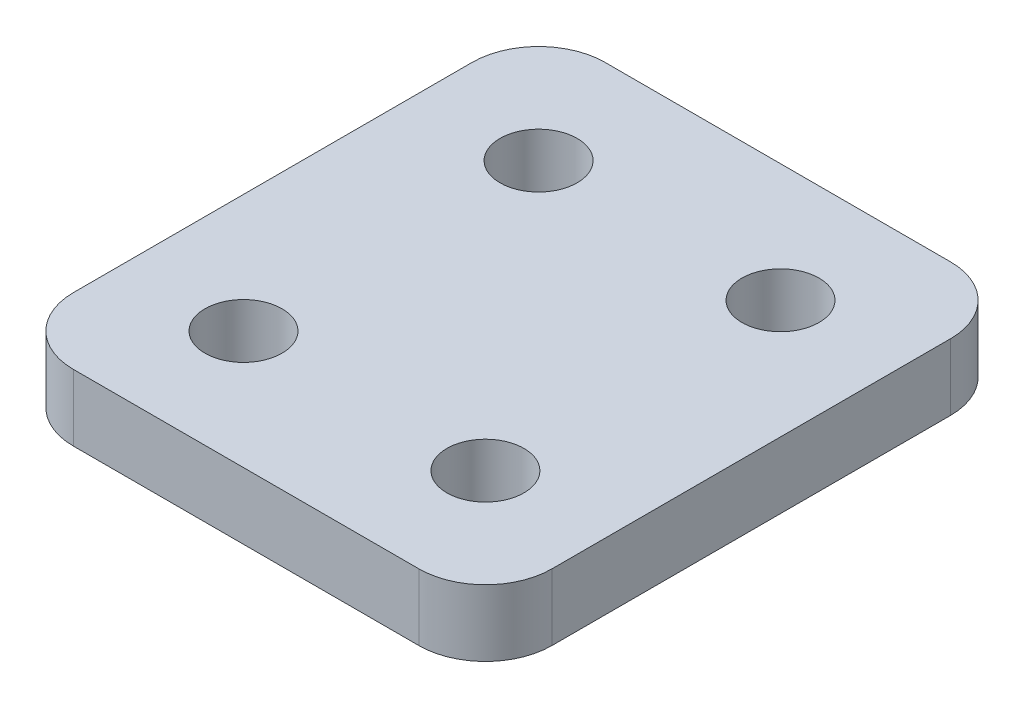
ISO-10303-21;
HEADER;
FILE_DESCRIPTION(('STEP AP214'),'2;1');
FILE_NAME('part.step','',(''),(''),'','','');
FILE_SCHEMA(('AUTOMOTIVE_DESIGN { 1 0 10303 214 1 1 1 1 }'));
ENDSEC;
DATA;
#1=APPLICATION_CONTEXT('core data for automotive mechanical design processes');
#2=APPLICATION_PROTOCOL_DEFINITION('international standard','automotive_design',2000,#1);
#3=PRODUCT_CONTEXT('',#1,'mechanical');
#4=PRODUCT('Part','Part','',(#3));
#5=PRODUCT_RELATED_PRODUCT_CATEGORY('part','',(#4));
#6=PRODUCT_DEFINITION_FORMATION('','',#4);
#7=PRODUCT_DEFINITION_CONTEXT('part definition',#1,'design');
#8=PRODUCT_DEFINITION('design','',#6,#7);
#9=PRODUCT_DEFINITION_SHAPE('','',#8);
#10=(LENGTH_UNIT() NAMED_UNIT(*) SI_UNIT(.MILLI.,.METRE.));
#11=(NAMED_UNIT(*) PLANE_ANGLE_UNIT() SI_UNIT($,.RADIAN.));
#12=(NAMED_UNIT(*) SI_UNIT($,.STERADIAN.) SOLID_ANGLE_UNIT());
#13=UNCERTAINTY_MEASURE_WITH_UNIT(LENGTH_MEASURE(1.E-05),#10,'distance_accuracy_value','');
#14=(GEOMETRIC_REPRESENTATION_CONTEXT(3) GLOBAL_UNCERTAINTY_ASSIGNED_CONTEXT((#13)) GLOBAL_UNIT_ASSIGNED_CONTEXT((#10,
#11,#12)) REPRESENTATION_CONTEXT('',''));
#15=CARTESIAN_POINT('',(0.,0.,0.));
#16=DIRECTION('',(0.,0.,1.));
#17=DIRECTION('',(1.,0.,0.));
#18=AXIS2_PLACEMENT_3D('',#15,#16,#17);
#19=CARTESIAN_POINT('',(9.144,2.54,10.16));
#20=DIRECTION('',(-1.,0.,0.));
#21=DIRECTION('',(0.,0.,1.));
#22=AXIS2_PLACEMENT_3D('',#19,#20,#21);
#23=PLANE('',#22);
#24=DIRECTION('',(0.,0.,-1.));
#25=VECTOR('',#24,1.);
#26=CARTESIAN_POINT('',(9.144,0.,10.16));
#27=LINE('',#26,#25);
#28=CARTESIAN_POINT('',(9.144,0.,7.62));
#29=VERTEX_POINT('',#28);
#30=CARTESIAN_POINT('',(9.144,0.,-7.62));
#31=VERTEX_POINT('',#30);
#32=EDGE_CURVE('E163',#29,#31,#27,.T.);
#33=ORIENTED_EDGE('',*,*,#32,.T.);
#34=DIRECTION('',(0.,-1.,0.));
#35=VECTOR('',#34,1.);
#36=CARTESIAN_POINT('',(9.144,2.54,-7.62));
#37=LINE('',#36,#35);
#38=CARTESIAN_POINT('',(9.144,2.54,-7.62));
#39=VERTEX_POINT('',#38);
#40=EDGE_CURVE('E11',#31,#39,#37,.F.);
#41=ORIENTED_EDGE('',*,*,#40,.T.);
#42=DIRECTION('',(0.,0.,-1.));
#43=VECTOR('',#42,1.);
#44=CARTESIAN_POINT('',(9.144,2.54,10.16));
#45=LINE('',#44,#43);
#46=CARTESIAN_POINT('',(9.144,2.54,7.62));
#47=VERTEX_POINT('',#46);
#48=EDGE_CURVE('E131',#47,#39,#45,.T.);
#49=ORIENTED_EDGE('',*,*,#48,.F.);
#50=DIRECTION('',(0.,-1.,0.));
#51=VECTOR('',#50,1.);
#52=CARTESIAN_POINT('',(9.144,2.54,7.62));
#53=LINE('',#52,#51);
#54=EDGE_CURVE('E47',#47,#29,#53,.T.);
#55=ORIENTED_EDGE('',*,*,#54,.T.);
#56=EDGE_LOOP('',(#33,#41,#49,#55));
#57=FACE_BOUND('',#56,.T.);
#58=ADVANCED_FACE('F39',(#57),#23,.F.);
#59=CARTESIAN_POINT('',(-9.144,2.54,-10.16));
#60=DIRECTION('',(0.,0.,1.));
#61=DIRECTION('',(1.,0.,0.));
#62=AXIS2_PLACEMENT_3D('',#59,#60,#61);
#63=PLANE('',#62);
#64=DIRECTION('',(-1.,0.,0.));
#65=VECTOR('',#64,1.);
#66=CARTESIAN_POINT('',(-9.144,0.,-10.16));
#67=LINE('',#66,#65);
#68=CARTESIAN_POINT('',(6.604,0.,-10.16));
#69=VERTEX_POINT('',#68);
#70=CARTESIAN_POINT('',(-6.604,0.,-10.16));
#71=VERTEX_POINT('',#70);
#72=EDGE_CURVE('E136',#69,#71,#67,.T.);
#73=ORIENTED_EDGE('',*,*,#72,.T.);
#74=DIRECTION('',(0.,-1.,0.));
#75=VECTOR('',#74,1.);
#76=CARTESIAN_POINT('',(-6.604,2.54,-10.16));
#77=LINE('',#76,#75);
#78=CARTESIAN_POINT('',(-6.604,2.54,-10.16));
#79=VERTEX_POINT('',#78);
#80=EDGE_CURVE('E54',#71,#79,#77,.F.);
#81=ORIENTED_EDGE('',*,*,#80,.T.);
#82=DIRECTION('',(-1.,0.,0.));
#83=VECTOR('',#82,1.);
#84=CARTESIAN_POINT('',(-9.144,2.54,-10.16));
#85=LINE('',#84,#83);
#86=CARTESIAN_POINT('',(6.604,2.54,-10.16));
#87=VERTEX_POINT('',#86);
#88=EDGE_CURVE('E134',#87,#79,#85,.T.);
#89=ORIENTED_EDGE('',*,*,#88,.F.);
#90=DIRECTION('',(0.,-1.,0.));
#91=VECTOR('',#90,1.);
#92=CARTESIAN_POINT('',(6.604,2.54,-10.16));
#93=LINE('',#92,#91);
#94=EDGE_CURVE('E155',#87,#69,#93,.T.);
#95=ORIENTED_EDGE('',*,*,#94,.T.);
#96=EDGE_LOOP('',(#73,#81,#89,#95));
#97=FACE_BOUND('',#96,.T.);
#98=ADVANCED_FACE('F215',(#97),#63,.F.);
#99=CARTESIAN_POINT('',(-9.144,2.54,10.16));
#100=DIRECTION('',(1.,0.,0.));
#101=DIRECTION('',(0.,0.,-1.));
#102=AXIS2_PLACEMENT_3D('',#99,#100,#101);
#103=PLANE('',#102);
#104=DIRECTION('',(0.,0.,1.));
#105=VECTOR('',#104,1.);
#106=CARTESIAN_POINT('',(-9.144,0.,10.16));
#107=LINE('',#106,#105);
#108=CARTESIAN_POINT('',(-9.144,0.,-7.62));
#109=VERTEX_POINT('',#108);
#110=CARTESIAN_POINT('',(-9.144,0.,7.62));
#111=VERTEX_POINT('',#110);
#112=EDGE_CURVE('E132',#109,#111,#107,.T.);
#113=ORIENTED_EDGE('',*,*,#112,.T.);
#114=DIRECTION('',(0.,-1.,0.));
#115=VECTOR('',#114,1.);
#116=CARTESIAN_POINT('',(-9.144,2.54,7.62));
#117=LINE('',#116,#115);
#118=CARTESIAN_POINT('',(-9.144,2.54,7.62));
#119=VERTEX_POINT('',#118);
#120=EDGE_CURVE('E110',#111,#119,#117,.F.);
#121=ORIENTED_EDGE('',*,*,#120,.T.);
#122=DIRECTION('',(0.,0.,1.));
#123=VECTOR('',#122,1.);
#124=CARTESIAN_POINT('',(-9.144,2.54,10.16));
#125=LINE('',#124,#123);
#126=CARTESIAN_POINT('',(-9.144,2.54,-7.62));
#127=VERTEX_POINT('',#126);
#128=EDGE_CURVE('E175',#127,#119,#125,.T.);
#129=ORIENTED_EDGE('',*,*,#128,.F.);
#130=DIRECTION('',(0.,-1.,0.));
#131=VECTOR('',#130,1.);
#132=CARTESIAN_POINT('',(-9.144,2.54,-7.62));
#133=LINE('',#132,#131);
#134=EDGE_CURVE('E115',#127,#109,#133,.T.);
#135=ORIENTED_EDGE('',*,*,#134,.T.);
#136=EDGE_LOOP('',(#113,#121,#129,#135));
#137=FACE_BOUND('',#136,.T.);
#138=ADVANCED_FACE('F212',(#137),#103,.F.);
#139=CARTESIAN_POINT('',(-9.144,2.54,10.16));
#140=DIRECTION('',(0.,0.,-1.));
#141=DIRECTION('',(-1.,0.,0.));
#142=AXIS2_PLACEMENT_3D('',#139,#140,#141);
#143=PLANE('',#142);
#144=DIRECTION('',(1.,0.,0.));
#145=VECTOR('',#144,1.);
#146=CARTESIAN_POINT('',(-9.144,2.54,10.16));
#147=LINE('',#146,#145);
#148=CARTESIAN_POINT('',(-6.604,2.54,10.16));
#149=VERTEX_POINT('',#148);
#150=CARTESIAN_POINT('',(6.604,2.54,10.16));
#151=VERTEX_POINT('',#150);
#152=EDGE_CURVE('E125',#149,#151,#147,.T.);
#153=ORIENTED_EDGE('',*,*,#152,.F.);
#154=DIRECTION('',(0.,-1.,0.));
#155=VECTOR('',#154,1.);
#156=CARTESIAN_POINT('',(-6.604,2.54,10.16));
#157=LINE('',#156,#155);
#158=CARTESIAN_POINT('',(-6.604,0.,10.16));
#159=VERTEX_POINT('',#158);
#160=EDGE_CURVE('E109',#149,#159,#157,.T.);
#161=ORIENTED_EDGE('',*,*,#160,.T.);
#162=DIRECTION('',(1.,0.,0.));
#163=VECTOR('',#162,1.);
#164=CARTESIAN_POINT('',(-9.144,0.,10.16));
#165=LINE('',#164,#163);
#166=CARTESIAN_POINT('',(6.604,0.,10.16));
#167=VERTEX_POINT('',#166);
#168=EDGE_CURVE('E122',#159,#167,#165,.T.);
#169=ORIENTED_EDGE('',*,*,#168,.T.);
#170=DIRECTION('',(0.,-1.,0.));
#171=VECTOR('',#170,1.);
#172=CARTESIAN_POINT('',(6.604,2.54,10.16));
#173=LINE('',#172,#171);
#174=EDGE_CURVE('E127',#167,#151,#173,.F.);
#175=ORIENTED_EDGE('',*,*,#174,.T.);
#176=EDGE_LOOP('',(#153,#161,#169,#175));
#177=FACE_BOUND('',#176,.T.);
#178=ADVANCED_FACE('F121',(#177),#143,.F.);
#179=CARTESIAN_POINT('',(0.,2.54,0.));
#180=DIRECTION('',(0.,-1.,0.));
#181=DIRECTION('',(0.,0.,-1.));
#182=AXIS2_PLACEMENT_3D('',#179,#180,#181);
#183=PLANE('',#182);
#184=CARTESIAN_POINT('',(4.6228,2.54,-5.6388));
#185=DIRECTION('',(0.,1.,0.));
#186=DIRECTION('',(0.,0.,-1.));
#187=AXIS2_PLACEMENT_3D('',#184,#185,#186);
#188=CIRCLE('',#187,1.4732);
#189=CARTESIAN_POINT('',(4.6228,2.54,-7.112));
#190=VERTEX_POINT('',#189);
#191=EDGE_CURVE('E185',#190,#190,#188,.T.);
#192=ORIENTED_EDGE('',*,*,#191,.F.);
#193=EDGE_LOOP('',(#192));
#194=FACE_BOUND('',#193,.T.);
#195=CARTESIAN_POINT('',(4.6228,2.54,5.6388));
#196=DIRECTION('',(0.,1.,0.));
#197=DIRECTION('',(0.,0.,1.));
#198=AXIS2_PLACEMENT_3D('',#195,#196,#197);
#199=CIRCLE('',#198,1.4732);
#200=CARTESIAN_POINT('',(4.6228,2.54,7.112));
#201=VERTEX_POINT('',#200);
#202=EDGE_CURVE('E191',#201,#201,#199,.T.);
#203=ORIENTED_EDGE('',*,*,#202,.F.);
#204=EDGE_LOOP('',(#203));
#205=FACE_BOUND('',#204,.T.);
#206=CARTESIAN_POINT('',(-4.6228,2.54,5.6388));
#207=DIRECTION('',(0.,1.,0.));
#208=DIRECTION('',(0.,0.,-1.));
#209=AXIS2_PLACEMENT_3D('',#206,#207,#208);
#210=CIRCLE('',#209,1.4732);
#211=CARTESIAN_POINT('',(-4.6228,2.54,4.1656));
#212=VERTEX_POINT('',#211);
#213=EDGE_CURVE('E180',#212,#212,#210,.T.);
#214=ORIENTED_EDGE('',*,*,#213,.F.);
#215=EDGE_LOOP('',(#214));
#216=FACE_BOUND('',#215,.T.);
#217=CARTESIAN_POINT('',(-4.6228,2.54,-5.6388));
#218=DIRECTION('',(0.,1.,0.));
#219=DIRECTION('',(0.,0.,1.));
#220=AXIS2_PLACEMENT_3D('',#217,#218,#219);
#221=CIRCLE('',#220,1.4732);
#222=CARTESIAN_POINT('',(-4.6228,2.54,-4.1656));
#223=VERTEX_POINT('',#222);
#224=EDGE_CURVE('E171',#223,#223,#221,.T.);
#225=ORIENTED_EDGE('',*,*,#224,.F.);
#226=EDGE_LOOP('',(#225));
#227=FACE_BOUND('',#226,.T.);
#228=ORIENTED_EDGE('',*,*,#128,.T.);
#229=CARTESIAN_POINT('',(-6.604,2.54,7.62));
#230=DIRECTION('',(0.,-1.,0.));
#231=DIRECTION('',(0.,0.,-1.));
#232=AXIS2_PLACEMENT_3D('',#229,#230,#231);
#233=CIRCLE('',#232,2.54);
#234=EDGE_CURVE('E153',#119,#149,#233,.F.);
#235=ORIENTED_EDGE('',*,*,#234,.T.);
#236=ORIENTED_EDGE('',*,*,#152,.T.);
#237=CARTESIAN_POINT('',(6.604,2.54,7.62));
#238=DIRECTION('',(0.,-1.,0.));
#239=DIRECTION('',(0.,0.,-1.));
#240=AXIS2_PLACEMENT_3D('',#237,#238,#239);
#241=CIRCLE('',#240,2.54);
#242=EDGE_CURVE('E148',#151,#47,#241,.F.);
#243=ORIENTED_EDGE('',*,*,#242,.T.);
#244=ORIENTED_EDGE('',*,*,#48,.T.);
#245=CARTESIAN_POINT('',(6.604,2.54,-7.62));
#246=DIRECTION('',(0.,-1.,0.));
#247=DIRECTION('',(0.,0.,-1.));
#248=AXIS2_PLACEMENT_3D('',#245,#246,#247);
#249=CIRCLE('',#248,2.54);
#250=EDGE_CURVE('E61',#39,#87,#249,.F.);
#251=ORIENTED_EDGE('',*,*,#250,.T.);
#252=ORIENTED_EDGE('',*,*,#88,.T.);
#253=CARTESIAN_POINT('',(-6.604,2.54,-7.62));
#254=DIRECTION('',(0.,-1.,0.));
#255=DIRECTION('',(0.,0.,-1.));
#256=AXIS2_PLACEMENT_3D('',#253,#254,#255);
#257=CIRCLE('',#256,2.54);
#258=EDGE_CURVE('E151',#79,#127,#257,.F.);
#259=ORIENTED_EDGE('',*,*,#258,.T.);
#260=EDGE_LOOP('',(#228,#235,#236,#243,#244,#251,#252,#259));
#261=FACE_BOUND('',#260,.T.);
#262=ADVANCED_FACE('F202',(#194,#205,#216,#227,#261),#183,.F.);
#263=CARTESIAN_POINT('',(0.,0.,0.));
#264=DIRECTION('',(0.,-1.,0.));
#265=DIRECTION('',(0.,0.,-1.));
#266=AXIS2_PLACEMENT_3D('',#263,#264,#265);
#267=PLANE('',#266);
#268=CARTESIAN_POINT('',(4.6228,0.,-5.6388));
#269=DIRECTION('',(0.,1.,0.));
#270=DIRECTION('',(0.,0.,-1.));
#271=AXIS2_PLACEMENT_3D('',#268,#269,#270);
#272=CIRCLE('',#271,1.4732);
#273=CARTESIAN_POINT('',(4.6228,0.,-7.112));
#274=VERTEX_POINT('',#273);
#275=EDGE_CURVE('E182',#274,#274,#272,.T.);
#276=ORIENTED_EDGE('',*,*,#275,.T.);
#277=EDGE_LOOP('',(#276));
#278=FACE_BOUND('',#277,.T.);
#279=CARTESIAN_POINT('',(4.6228,0.,5.6388));
#280=DIRECTION('',(0.,1.,0.));
#281=DIRECTION('',(0.,0.,1.));
#282=AXIS2_PLACEMENT_3D('',#279,#280,#281);
#283=CIRCLE('',#282,1.4732);
#284=CARTESIAN_POINT('',(4.6228,0.,7.112));
#285=VERTEX_POINT('',#284);
#286=EDGE_CURVE('E188',#285,#285,#283,.T.);
#287=ORIENTED_EDGE('',*,*,#286,.T.);
#288=EDGE_LOOP('',(#287));
#289=FACE_BOUND('',#288,.T.);
#290=CARTESIAN_POINT('',(-4.6228,0.,5.6388));
#291=DIRECTION('',(0.,1.,0.));
#292=DIRECTION('',(0.,0.,-1.));
#293=AXIS2_PLACEMENT_3D('',#290,#291,#292);
#294=CIRCLE('',#293,1.4732);
#295=CARTESIAN_POINT('',(-4.6228,0.,4.1656));
#296=VERTEX_POINT('',#295);
#297=EDGE_CURVE('E194',#296,#296,#294,.T.);
#298=ORIENTED_EDGE('',*,*,#297,.T.);
#299=EDGE_LOOP('',(#298));
#300=FACE_BOUND('',#299,.T.);
#301=CARTESIAN_POINT('',(-4.6228,0.,-5.6388));
#302=DIRECTION('',(0.,1.,0.));
#303=DIRECTION('',(0.,0.,1.));
#304=AXIS2_PLACEMENT_3D('',#301,#302,#303);
#305=CIRCLE('',#304,1.4732);
#306=CARTESIAN_POINT('',(-4.6228,0.,-4.1656));
#307=VERTEX_POINT('',#306);
#308=EDGE_CURVE('E168',#307,#307,#305,.T.);
#309=ORIENTED_EDGE('',*,*,#308,.T.);
#310=EDGE_LOOP('',(#309));
#311=FACE_BOUND('',#310,.T.);
#312=ORIENTED_EDGE('',*,*,#168,.F.);
#313=CARTESIAN_POINT('',(-6.604,0.,7.62));
#314=DIRECTION('',(0.,-1.,0.));
#315=DIRECTION('',(0.,0.,-1.));
#316=AXIS2_PLACEMENT_3D('',#313,#314,#315);
#317=CIRCLE('',#316,2.54);
#318=EDGE_CURVE('E105',#159,#111,#317,.T.);
#319=ORIENTED_EDGE('',*,*,#318,.T.);
#320=ORIENTED_EDGE('',*,*,#112,.F.);
#321=CARTESIAN_POINT('',(-6.604,0.,-7.62));
#322=DIRECTION('',(0.,-1.,0.));
#323=DIRECTION('',(0.,0.,-1.));
#324=AXIS2_PLACEMENT_3D('',#321,#322,#323);
#325=CIRCLE('',#324,2.54);
#326=EDGE_CURVE('E116',#109,#71,#325,.T.);
#327=ORIENTED_EDGE('',*,*,#326,.T.);
#328=ORIENTED_EDGE('',*,*,#72,.F.);
#329=CARTESIAN_POINT('',(6.604,0.,-7.62));
#330=DIRECTION('',(0.,-1.,0.));
#331=DIRECTION('',(0.,0.,-1.));
#332=AXIS2_PLACEMENT_3D('',#329,#330,#331);
#333=CIRCLE('',#332,2.54);
#334=EDGE_CURVE('E142',#69,#31,#333,.T.);
#335=ORIENTED_EDGE('',*,*,#334,.T.);
#336=ORIENTED_EDGE('',*,*,#32,.F.);
#337=CARTESIAN_POINT('',(6.604,0.,7.62));
#338=DIRECTION('',(0.,-1.,0.));
#339=DIRECTION('',(0.,0.,-1.));
#340=AXIS2_PLACEMENT_3D('',#337,#338,#339);
#341=CIRCLE('',#340,2.54);
#342=EDGE_CURVE('E126',#29,#167,#341,.T.);
#343=ORIENTED_EDGE('',*,*,#342,.T.);
#344=EDGE_LOOP('',(#312,#319,#320,#327,#328,#335,#336,#343));
#345=FACE_BOUND('',#344,.T.);
#346=ADVANCED_FACE('F129',(#278,#289,#300,#311,#345),#267,.T.);
#347=CARTESIAN_POINT('',(-4.6228,0.,-5.6388));
#348=DIRECTION('',(0.,1.,0.));
#349=DIRECTION('',(0.,0.,1.));
#350=AXIS2_PLACEMENT_3D('',#347,#348,#349);
#351=CYLINDRICAL_SURFACE('',#350,1.4732);
#352=ORIENTED_EDGE('',*,*,#308,.F.);
#353=EDGE_LOOP('',(#352));
#354=FACE_BOUND('',#353,.T.);
#355=ORIENTED_EDGE('',*,*,#224,.T.);
#356=EDGE_LOOP('',(#355));
#357=FACE_BOUND('',#356,.T.);
#358=ADVANCED_FACE('F280',(#354,#357),#351,.F.);
#359=CARTESIAN_POINT('',(-4.6228,0.,5.6388));
#360=DIRECTION('',(0.,1.,0.));
#361=DIRECTION('',(0.,0.,1.));
#362=AXIS2_PLACEMENT_3D('',#359,#360,#361);
#363=CYLINDRICAL_SURFACE('',#362,1.4732);
#364=ORIENTED_EDGE('',*,*,#297,.F.);
#365=EDGE_LOOP('',(#364));
#366=FACE_BOUND('',#365,.T.);
#367=ORIENTED_EDGE('',*,*,#213,.T.);
#368=EDGE_LOOP('',(#367));
#369=FACE_BOUND('',#368,.T.);
#370=ADVANCED_FACE('F200',(#366,#369),#363,.F.);
#371=CARTESIAN_POINT('',(4.6228,0.,5.6388));
#372=DIRECTION('',(0.,1.,0.));
#373=DIRECTION('',(0.,0.,1.));
#374=AXIS2_PLACEMENT_3D('',#371,#372,#373);
#375=CYLINDRICAL_SURFACE('',#374,1.4732);
#376=ORIENTED_EDGE('',*,*,#286,.F.);
#377=EDGE_LOOP('',(#376));
#378=FACE_BOUND('',#377,.T.);
#379=ORIENTED_EDGE('',*,*,#202,.T.);
#380=EDGE_LOOP('',(#379));
#381=FACE_BOUND('',#380,.T.);
#382=ADVANCED_FACE('F263',(#378,#381),#375,.F.);
#383=CARTESIAN_POINT('',(4.6228,0.,-5.6388));
#384=DIRECTION('',(0.,1.,0.));
#385=DIRECTION('',(0.,0.,1.));
#386=AXIS2_PLACEMENT_3D('',#383,#384,#385);
#387=CYLINDRICAL_SURFACE('',#386,1.4732);
#388=ORIENTED_EDGE('',*,*,#275,.F.);
#389=EDGE_LOOP('',(#388));
#390=FACE_BOUND('',#389,.T.);
#391=ORIENTED_EDGE('',*,*,#191,.T.);
#392=EDGE_LOOP('',(#391));
#393=FACE_BOUND('',#392,.T.);
#394=ADVANCED_FACE('F234',(#390,#393),#387,.F.);
#395=CARTESIAN_POINT('',(-6.604,2.54,7.62));
#396=DIRECTION('',(0.,-1.,0.));
#397=DIRECTION('',(0.,0.,-1.));
#398=AXIS2_PLACEMENT_3D('',#395,#396,#397);
#399=CYLINDRICAL_SURFACE('',#398,2.54);
#400=ORIENTED_EDGE('',*,*,#234,.F.);
#401=ORIENTED_EDGE('',*,*,#120,.F.);
#402=ORIENTED_EDGE('',*,*,#318,.F.);
#403=ORIENTED_EDGE('',*,*,#160,.F.);
#404=EDGE_LOOP('',(#400,#401,#402,#403));
#405=FACE_BOUND('',#404,.T.);
#406=ADVANCED_FACE('F108',(#405),#399,.T.);
#407=CARTESIAN_POINT('',(-6.604,2.54,-7.62));
#408=DIRECTION('',(0.,-1.,0.));
#409=DIRECTION('',(0.,0.,-1.));
#410=AXIS2_PLACEMENT_3D('',#407,#408,#409);
#411=CYLINDRICAL_SURFACE('',#410,2.54);
#412=ORIENTED_EDGE('',*,*,#258,.F.);
#413=ORIENTED_EDGE('',*,*,#80,.F.);
#414=ORIENTED_EDGE('',*,*,#326,.F.);
#415=ORIENTED_EDGE('',*,*,#134,.F.);
#416=EDGE_LOOP('',(#412,#413,#414,#415));
#417=FACE_BOUND('',#416,.T.);
#418=ADVANCED_FACE('F214',(#417),#411,.T.);
#419=CARTESIAN_POINT('',(6.604,2.54,-7.62));
#420=DIRECTION('',(0.,-1.,0.));
#421=DIRECTION('',(0.,0.,-1.));
#422=AXIS2_PLACEMENT_3D('',#419,#420,#421);
#423=CYLINDRICAL_SURFACE('',#422,2.54);
#424=ORIENTED_EDGE('',*,*,#250,.F.);
#425=ORIENTED_EDGE('',*,*,#40,.F.);
#426=ORIENTED_EDGE('',*,*,#334,.F.);
#427=ORIENTED_EDGE('',*,*,#94,.F.);
#428=EDGE_LOOP('',(#424,#425,#426,#427));
#429=FACE_BOUND('',#428,.T.);
#430=ADVANCED_FACE('F218',(#429),#423,.T.);
#431=CARTESIAN_POINT('',(6.604,2.54,7.62));
#432=DIRECTION('',(0.,-1.,0.));
#433=DIRECTION('',(0.,0.,-1.));
#434=AXIS2_PLACEMENT_3D('',#431,#432,#433);
#435=CYLINDRICAL_SURFACE('',#434,2.54);
#436=ORIENTED_EDGE('',*,*,#242,.F.);
#437=ORIENTED_EDGE('',*,*,#174,.F.);
#438=ORIENTED_EDGE('',*,*,#342,.F.);
#439=ORIENTED_EDGE('',*,*,#54,.F.);
#440=EDGE_LOOP('',(#436,#437,#438,#439));
#441=FACE_BOUND('',#440,.T.);
#442=ADVANCED_FACE('F41',(#441),#435,.T.);
#443=CLOSED_SHELL('',(#58,#98,#138,#178,#262,#346,#358,#370,#382,#394,#406,#418,#430,#442));
#444=MANIFOLD_SOLID_BREP('B2',#443);
#445=ADVANCED_BREP_SHAPE_REPRESENTATION('',(#18,#444),#14);
#446=SHAPE_DEFINITION_REPRESENTATION(#9,#445);
ENDSEC;
END-ISO-10303-21;
